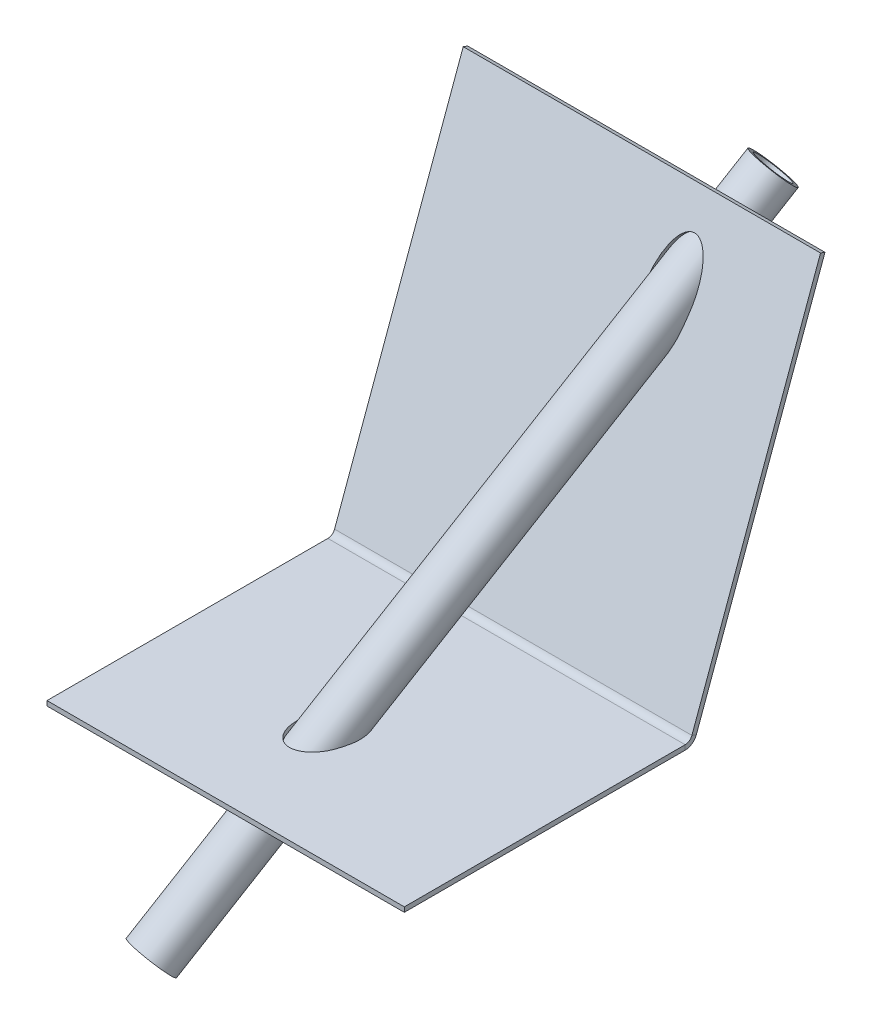
ISO-10303-21;
HEADER;
FILE_DESCRIPTION(('STEP AP214'),'2;1');
FILE_NAME('part.step','',(''),(''),'','','');
FILE_SCHEMA(('AUTOMOTIVE_DESIGN { 1 0 10303 214 1 1 1 1 }'));
ENDSEC;
DATA;
#1=APPLICATION_CONTEXT('core data for automotive mechanical design processes');
#2=APPLICATION_PROTOCOL_DEFINITION('international standard','automotive_design',2000,#1);
#3=PRODUCT_CONTEXT('',#1,'mechanical');
#4=PRODUCT('Part','Part','',(#3));
#5=PRODUCT_RELATED_PRODUCT_CATEGORY('part','',(#4));
#6=PRODUCT_DEFINITION_FORMATION('','',#4);
#7=PRODUCT_DEFINITION_CONTEXT('part definition',#1,'design');
#8=PRODUCT_DEFINITION('design','',#6,#7);
#9=PRODUCT_DEFINITION_SHAPE('','',#8);
#10=(LENGTH_UNIT() NAMED_UNIT(*) SI_UNIT(.MILLI.,.METRE.));
#11=(NAMED_UNIT(*) PLANE_ANGLE_UNIT() SI_UNIT($,.RADIAN.));
#12=(NAMED_UNIT(*) SI_UNIT($,.STERADIAN.) SOLID_ANGLE_UNIT());
#13=UNCERTAINTY_MEASURE_WITH_UNIT(LENGTH_MEASURE(1.E-05),#10,'distance_accuracy_value','');
#14=(GEOMETRIC_REPRESENTATION_CONTEXT(3) GLOBAL_UNCERTAINTY_ASSIGNED_CONTEXT((#13)) GLOBAL_UNIT_ASSIGNED_CONTEXT((#10,
#11,#12)) REPRESENTATION_CONTEXT('',''));
#15=CARTESIAN_POINT('',(0.,0.,0.));
#16=DIRECTION('',(0.,0.,1.));
#17=DIRECTION('',(1.,0.,0.));
#18=AXIS2_PLACEMENT_3D('',#15,#16,#17);
#19=CARTESIAN_POINT('',(-94.9837693608942,-60.5041507108473,131.214828829502));
#20=DIRECTION('',(0.173648177666931,0.696364240320019,-0.696364240320019));
#21=DIRECTION('',(0.,0.707106781186548,0.707106781186547));
#22=AXIS2_PLACEMENT_3D('',#19,#20,#21);
#23=CYLINDRICAL_SURFACE('',#22,9.50000000000002);
#24=CARTESIAN_POINT('',(-94.9837693608942,-60.5041507108473,131.214828829502));
#25=DIRECTION('',(0.173648177666931,0.696364240320019,-0.696364240320019));
#26=DIRECTION('',(0.,0.707106781186548,0.707106781186547));
#27=AXIS2_PLACEMENT_3D('',#24,#25,#26);
#28=CIRCLE('',#27,9.50000000000002);
#29=CARTESIAN_POINT('',(-94.9837693608942,-53.7866362895751,137.932343250774));
#30=VERTEX_POINT('',#29);
#31=EDGE_CURVE('E12',#30,#30,#28,.T.);
#32=ORIENTED_EDGE('',*,*,#31,.T.);
#33=EDGE_LOOP('',(#32));
#34=FACE_BOUND('',#33,.T.);
#35=CARTESIAN_POINT('',(-42.889316060815,148.405121385158,-77.6944432665036));
#36=DIRECTION('',(0.173648177666931,0.696364240320019,-0.696364240320019));
#37=DIRECTION('',(0.,0.707106781186548,0.707106781186547));
#38=AXIS2_PLACEMENT_3D('',#35,#36,#37);
#39=CIRCLE('',#38,9.50000000000002);
#40=CARTESIAN_POINT('',(-42.889316060815,155.122635806431,-70.9769288452314));
#41=VERTEX_POINT('',#40);
#42=EDGE_CURVE('E107',#41,#41,#39,.T.);
#43=ORIENTED_EDGE('',*,*,#42,.F.);
#44=EDGE_LOOP('',(#43));
#45=FACE_BOUND('',#44,.T.);
#46=ADVANCED_FACE('F97',(#34,#45),#23,.T.);
#47=CARTESIAN_POINT('',(-94.9837693608942,-60.5041507108473,131.214828829502));
#48=DIRECTION('',(0.173648177666931,0.696364240320019,-0.696364240320019));
#49=DIRECTION('',(0.,0.707106781186548,0.707106781186547));
#50=AXIS2_PLACEMENT_3D('',#47,#48,#49);
#51=PLANE('',#50);
#52=CARTESIAN_POINT('',(-94.9837693608942,-60.5041507108473,131.214828829502));
#53=DIRECTION('',(0.173648177666931,0.696364240320019,-0.696364240320019));
#54=DIRECTION('',(0.,0.707106781186548,0.707106781186548));
#55=AXIS2_PLACEMENT_3D('',#52,#53,#54);
#56=CIRCLE('',#55,7.50000000000001);
#57=CARTESIAN_POINT('',(-94.9837693608942,-55.2008498519482,136.518129688401));
#58=VERTEX_POINT('',#57);
#59=EDGE_CURVE('E103',#58,#58,#56,.T.);
#60=ORIENTED_EDGE('',*,*,#59,.T.);
#61=EDGE_LOOP('',(#60));
#62=FACE_BOUND('',#61,.T.);
#63=ORIENTED_EDGE('',*,*,#31,.F.);
#64=EDGE_LOOP('',(#63));
#65=FACE_BOUND('',#64,.T.);
#66=ADVANCED_FACE('F126',(#62,#65),#51,.F.);
#67=CARTESIAN_POINT('',(-94.9837693608942,-60.5041507108473,131.214828829502));
#68=DIRECTION('',(0.173648177666931,0.696364240320019,-0.696364240320019));
#69=DIRECTION('',(0.,0.707106781186548,0.707106781186547));
#70=AXIS2_PLACEMENT_3D('',#67,#68,#69);
#71=CYLINDRICAL_SURFACE('',#70,7.50000000000001);
#72=ORIENTED_EDGE('',*,*,#59,.F.);
#73=EDGE_LOOP('',(#72));
#74=FACE_BOUND('',#73,.T.);
#75=CARTESIAN_POINT('',(-42.889316060815,148.405121385158,-77.6944432665036));
#76=DIRECTION('',(0.173648177666931,0.696364240320019,-0.696364240320019));
#77=DIRECTION('',(0.,0.707106781186548,0.707106781186548));
#78=AXIS2_PLACEMENT_3D('',#75,#76,#77);
#79=CIRCLE('',#78,7.50000000000001);
#80=CARTESIAN_POINT('',(-42.889316060815,153.708422244057,-72.3911424076045));
#81=VERTEX_POINT('',#80);
#82=EDGE_CURVE('E111',#81,#81,#79,.T.);
#83=ORIENTED_EDGE('',*,*,#82,.T.);
#84=EDGE_LOOP('',(#83));
#85=FACE_BOUND('',#84,.T.);
#86=ADVANCED_FACE('F117',(#74,#85),#71,.F.);
#87=CARTESIAN_POINT('',(-42.889316060815,148.405121385158,-77.6944432665036));
#88=DIRECTION('',(0.173648177666931,0.696364240320019,-0.696364240320019));
#89=DIRECTION('',(0.,0.707106781186548,0.707106781186547));
#90=AXIS2_PLACEMENT_3D('',#87,#88,#89);
#91=PLANE('',#90);
#92=ORIENTED_EDGE('',*,*,#42,.T.);
#93=EDGE_LOOP('',(#92));
#94=FACE_BOUND('',#93,.T.);
#95=ORIENTED_EDGE('',*,*,#82,.F.);
#96=EDGE_LOOP('',(#95));
#97=FACE_BOUND('',#96,.T.);
#98=ADVANCED_FACE('F119',(#94,#97),#91,.T.);
#99=CLOSED_SHELL('',(#46,#66,#86,#98));
#100=MANIFOLD_SOLID_BREP('B2',#99);
#101=CARTESIAN_POINT('',(-150.,0.,2.10062261462914));
#102=DIRECTION('',(-1.,0.,0.));
#103=DIRECTION('',(0.,0.,1.));
#104=AXIS2_PLACEMENT_3D('',#101,#102,#103);
#105=PLANE('',#104);
#106=DIRECTION('',(0.,-1.,0.));
#107=VECTOR('',#106,1.);
#108=CARTESIAN_POINT('',(-150.,0.,2.10062261462914));
#109=LINE('',#108,#107);
#110=CARTESIAN_POINT('',(-150.,0.,2.10062261462914));
#111=VERTEX_POINT('',#110);
#112=CARTESIAN_POINT('',(-150.,-2.,2.10062261462914));
#113=VERTEX_POINT('',#112);
#114=EDGE_CURVE('E373',#111,#113,#109,.T.);
#115=ORIENTED_EDGE('',*,*,#114,.F.);
#116=CARTESIAN_POINT('',(-150.,3.,2.10062261462914));
#117=DIRECTION('',(-1.,0.,0.));
#118=DIRECTION('',(0.,0.,1.));
#119=AXIS2_PLACEMENT_3D('',#116,#117,#118);
#120=CIRCLE('',#119,3.);
#121=CARTESIAN_POINT('',(-150.,1.97393957002301,-0.718455247728592));
#122=VERTEX_POINT('',#121);
#123=EDGE_CURVE('E435',#111,#122,#120,.F.);
#124=ORIENTED_EDGE('',*,*,#123,.T.);
#125=DIRECTION('',(0.,0.342020143325665,0.93969262078591));
#126=VECTOR('',#125,1.);
#127=CARTESIAN_POINT('',(-150.,1.28989928337168,-2.59784048930041));
#128=LINE('',#127,#126);
#129=CARTESIAN_POINT('',(-150.,1.28989928337168,-2.59784048930041));
#130=VERTEX_POINT('',#129);
#131=EDGE_CURVE('E377',#130,#122,#128,.T.);
#132=ORIENTED_EDGE('',*,*,#131,.F.);
#133=CARTESIAN_POINT('',(-150.,3.,2.10062261462914));
#134=DIRECTION('',(1.,0.,0.));
#135=DIRECTION('',(0.,0.,-1.));
#136=AXIS2_PLACEMENT_3D('',#133,#134,#135);
#137=CIRCLE('',#136,5.);
#138=EDGE_CURVE('E387',#113,#130,#137,.T.);
#139=ORIENTED_EDGE('',*,*,#138,.F.);
#140=EDGE_LOOP('',(#115,#124,#132,#139));
#141=FACE_BOUND('',#140,.T.);
#142=ADVANCED_FACE('F159',(#141),#105,.T.);
#143=CARTESIAN_POINT('',(-150.,1.28989928337168,-2.59784048930041));
#144=DIRECTION('',(-1.,0.,0.));
#145=DIRECTION('',(0.,0.,1.));
#146=AXIS2_PLACEMENT_3D('',#143,#144,#145);
#147=PLANE('',#146);
#148=DIRECTION('',(0.,0.,-1.));
#149=VECTOR('',#148,1.);
#150=CARTESIAN_POINT('',(-150.,0.,120.));
#151=LINE('',#150,#149);
#152=CARTESIAN_POINT('',(-150.,0.,120.));
#153=VERTEX_POINT('',#152);
#154=EDGE_CURVE('E376',#153,#111,#151,.T.);
#155=ORIENTED_EDGE('',*,*,#154,.T.);
#156=ORIENTED_EDGE('',*,*,#114,.T.);
#157=DIRECTION('',(0.,0.,-1.));
#158=VECTOR('',#157,1.);
#159=CARTESIAN_POINT('',(-150.,-2.,120.));
#160=LINE('',#159,#158);
#161=CARTESIAN_POINT('',(-150.,-2.,120.));
#162=VERTEX_POINT('',#161);
#163=EDGE_CURVE('E409',#162,#113,#160,.T.);
#164=ORIENTED_EDGE('',*,*,#163,.F.);
#165=DIRECTION('',(0.,1.,0.));
#166=VECTOR('',#165,1.);
#167=CARTESIAN_POINT('',(-150.,-2.,120.));
#168=LINE('',#167,#166);
#169=EDGE_CURVE('E375',#162,#153,#168,.T.);
#170=ORIENTED_EDGE('',*,*,#169,.T.);
#171=EDGE_LOOP('',(#155,#156,#164,#170));
#172=FACE_BOUND('',#171,.T.);
#173=ADVANCED_FACE('F485',(#172),#147,.T.);
#174=CARTESIAN_POINT('',(0.,1.97393957002301,-0.718455247728592));
#175=DIRECTION('',(1.,0.,0.));
#176=DIRECTION('',(0.,0.,-1.));
#177=AXIS2_PLACEMENT_3D('',#174,#175,#176);
#178=PLANE('',#177);
#179=DIRECTION('',(0.,-0.342020143325665,-0.93969262078591));
#180=VECTOR('',#179,1.);
#181=CARTESIAN_POINT('',(0.,1.97393957002301,-0.718455247728592));
#182=LINE('',#181,#180);
#183=CARTESIAN_POINT('',(0.,1.97393957002301,-0.718455247728592));
#184=VERTEX_POINT('',#183);
#185=CARTESIAN_POINT('',(0.,1.28989928337168,-2.59784048930041));
#186=VERTEX_POINT('',#185);
#187=EDGE_CURVE('E381',#184,#186,#182,.T.);
#188=ORIENTED_EDGE('',*,*,#187,.F.);
#189=CARTESIAN_POINT('',(0.,3.,2.10062261462914));
#190=DIRECTION('',(-1.,0.,0.));
#191=DIRECTION('',(0.,0.,1.));
#192=AXIS2_PLACEMENT_3D('',#189,#190,#191);
#193=CIRCLE('',#192,3.);
#194=CARTESIAN_POINT('',(0.,0.,2.10062261462914));
#195=VERTEX_POINT('',#194);
#196=EDGE_CURVE('E398',#195,#184,#193,.F.);
#197=ORIENTED_EDGE('',*,*,#196,.F.);
#198=DIRECTION('',(0.,1.,0.));
#199=VECTOR('',#198,1.);
#200=CARTESIAN_POINT('',(0.,-2.,2.10062261462914));
#201=LINE('',#200,#199);
#202=CARTESIAN_POINT('',(0.,-2.,2.10062261462914));
#203=VERTEX_POINT('',#202);
#204=EDGE_CURVE('E95',#203,#195,#201,.T.);
#205=ORIENTED_EDGE('',*,*,#204,.F.);
#206=CARTESIAN_POINT('',(0.,3.,2.10062261462914));
#207=DIRECTION('',(1.,0.,0.));
#208=DIRECTION('',(0.,0.,-1.));
#209=AXIS2_PLACEMENT_3D('',#206,#207,#208);
#210=CIRCLE('',#209,5.);
#211=EDGE_CURVE('E383',#203,#186,#210,.T.);
#212=ORIENTED_EDGE('',*,*,#211,.T.);
#213=EDGE_LOOP('',(#188,#197,#205,#212));
#214=FACE_BOUND('',#213,.T.);
#215=ADVANCED_FACE('F469',(#214),#178,.T.);
#216=CARTESIAN_POINT('',(0.,-2.,2.10062261462914));
#217=DIRECTION('',(1.,0.,0.));
#218=DIRECTION('',(0.,0.,-1.));
#219=AXIS2_PLACEMENT_3D('',#216,#217,#218);
#220=PLANE('',#219);
#221=DIRECTION('',(0.,0.93969262078591,-0.342020143325666));
#222=VECTOR('',#221,1.);
#223=CARTESIAN_POINT('',(0.,0.,0.));
#224=LINE('',#223,#222);
#225=CARTESIAN_POINT('',(0.,150.350819325746,-54.7232229321065));
#226=VERTEX_POINT('',#225);
#227=EDGE_CURVE('E394',#184,#226,#224,.T.);
#228=ORIENTED_EDGE('',*,*,#227,.F.);
#229=ORIENTED_EDGE('',*,*,#187,.T.);
#230=DIRECTION('',(0.,0.93969262078591,-0.342020143325666));
#231=VECTOR('',#230,1.);
#232=CARTESIAN_POINT('',(0.,-0.684040286651331,-1.87938524157182));
#233=LINE('',#232,#231);
#234=CARTESIAN_POINT('',(0.,149.666779039094,-56.6026081736783));
#235=VERTEX_POINT('',#234);
#236=EDGE_CURVE('E382',#186,#235,#233,.T.);
#237=ORIENTED_EDGE('',*,*,#236,.T.);
#238=DIRECTION('',(0.,-0.342020143325655,-0.939692620785913));
#239=VECTOR('',#238,1.);
#240=CARTESIAN_POINT('',(0.,150.350819325746,-54.7232229321065));
#241=LINE('',#240,#239);
#242=EDGE_CURVE('E390',#226,#235,#241,.T.);
#243=ORIENTED_EDGE('',*,*,#242,.F.);
#244=EDGE_LOOP('',(#228,#229,#237,#243));
#245=FACE_BOUND('',#244,.T.);
#246=ADVANCED_FACE('F467',(#245),#220,.T.);
#247=CARTESIAN_POINT('',(-150.,-0.684040286651331,-1.87938524157182));
#248=DIRECTION('',(0.,-0.342020143325666,-0.93969262078591));
#249=DIRECTION('',(0.,0.93969262078591,-0.342020143325666));
#250=AXIS2_PLACEMENT_3D('',#247,#248,#249);
#251=PLANE('',#250);
#252=CARTESIAN_POINT('',(-52.1731413119094,110.491068062365,-42.3438154719332));
#253=DIRECTION('',(0.,-0.342020143325666,-0.93969262078591));
#254=DIRECTION('',(0.19097450619064,0.922397575209378,-0.335725261535531));
#255=AXIS2_PLACEMENT_3D('',#252,#253,#254);
#256=ELLIPSE('',#255,22.8256885378825,9.50000000000002);
#257=CARTESIAN_POINT('',(-42.8428854587484,108.810888513388,-41.7322801278828));
#258=VERTEX_POINT('',#257);
#259=CARTESIAN_POINT('',(-61.4748454872845,112.308830651762,-43.0054269474365));
#260=VERTEX_POINT('',#259);
#261=EDGE_CURVE('E361',#258,#260,#256,.T.);
#262=ORIENTED_EDGE('',*,*,#261,.F.);
#263=DIRECTION('',(-0.19097304177923,-0.922397842935195,0.335725358979759));
#264=VECTOR('',#263,1.);
#265=CARTESIAN_POINT('',(-42.0084382959595,112.841243756615,-43.1992094699363));
#266=LINE('',#265,#264);
#267=CARTESIAN_POINT('',(-42.0084382959595,112.841243756615,-43.1992094699363));
#268=VERTEX_POINT('',#267);
#269=EDGE_CURVE('E364',#268,#258,#266,.T.);
#270=ORIENTED_EDGE('',*,*,#269,.F.);
#271=CARTESIAN_POINT('',(-51.3386909500997,114.521422719219,-43.8107446005643));
#272=DIRECTION('',(0.,-0.342020143325666,-0.93969262078591));
#273=DIRECTION('',(0.19097450619064,0.922397575209378,-0.335725261535531));
#274=AXIS2_PLACEMENT_3D('',#271,#272,#273);
#275=ELLIPSE('',#274,22.8256885378825,9.50000000000002);
#276=CARTESIAN_POINT('',(-60.6403951549392,116.33918516798,-44.4723560248802));
#277=VERTEX_POINT('',#276);
#278=EDGE_CURVE('E366',#277,#268,#275,.T.);
#279=ORIENTED_EDGE('',*,*,#278,.F.);
#280=DIRECTION('',(0.190974506190639,0.922397575209378,-0.335725261535531));
#281=VECTOR('',#280,1.);
#282=CARTESIAN_POINT('',(-61.4749125583194,112.308842913835,-43.005431410466));
#283=LINE('',#282,#281);
#284=EDGE_CURVE('E369',#260,#277,#283,.T.);
#285=ORIENTED_EDGE('',*,*,#284,.F.);
#286=EDGE_LOOP('',(#262,#270,#279,#285));
#287=FACE_BOUND('',#286,.T.);
#288=ORIENTED_EDGE('',*,*,#236,.F.);
#289=DIRECTION('',(1.,0.,0.));
#290=VECTOR('',#289,1.);
#291=CARTESIAN_POINT('',(-150.,1.28989928337168,-2.59784048930041));
#292=LINE('',#291,#290);
#293=EDGE_CURVE('E410',#130,#186,#292,.T.);
#294=ORIENTED_EDGE('',*,*,#293,.F.);
#295=DIRECTION('',(0.,0.93969262078591,-0.342020143325666));
#296=VECTOR('',#295,1.);
#297=CARTESIAN_POINT('',(-150.,-0.684040286651331,-1.87938524157182));
#298=LINE('',#297,#296);
#299=CARTESIAN_POINT('',(-150.,149.666779039094,-56.6026081736783));
#300=VERTEX_POINT('',#299);
#301=EDGE_CURVE('E163',#130,#300,#298,.T.);
#302=ORIENTED_EDGE('',*,*,#301,.T.);
#303=DIRECTION('',(1.,0.,0.));
#304=VECTOR('',#303,1.);
#305=CARTESIAN_POINT('',(-150.,149.666779039094,-56.6026081736783));
#306=LINE('',#305,#304);
#307=EDGE_CURVE('E385',#300,#235,#306,.T.);
#308=ORIENTED_EDGE('',*,*,#307,.T.);
#309=EDGE_LOOP('',(#288,#294,#302,#308));
#310=FACE_BOUND('',#309,.T.);
#311=ADVANCED_FACE('F161',(#287,#310),#251,.T.);
#312=CARTESIAN_POINT('',(-150.,3.,2.10062261462914));
#313=DIRECTION('',(1.,0.,0.));
#314=DIRECTION('',(0.,0.,-1.));
#315=AXIS2_PLACEMENT_3D('',#312,#313,#314);
#316=CYLINDRICAL_SURFACE('',#315,5.);
#317=ORIENTED_EDGE('',*,*,#211,.F.);
#318=DIRECTION('',(1.,0.,0.));
#319=VECTOR('',#318,1.);
#320=CARTESIAN_POINT('',(-150.,-2.,2.10062261462914));
#321=LINE('',#320,#319);
#322=EDGE_CURVE('E406',#113,#203,#321,.T.);
#323=ORIENTED_EDGE('',*,*,#322,.F.);
#324=ORIENTED_EDGE('',*,*,#138,.T.);
#325=ORIENTED_EDGE('',*,*,#293,.T.);
#326=EDGE_LOOP('',(#317,#323,#324,#325));
#327=FACE_BOUND('',#326,.T.);
#328=ADVANCED_FACE('F454',(#327),#316,.T.);
#329=CARTESIAN_POINT('',(-150.,-2.,120.));
#330=DIRECTION('',(0.,-1.,0.));
#331=DIRECTION('',(0.,0.,-1.));
#332=AXIS2_PLACEMENT_3D('',#329,#330,#331);
#333=PLANE('',#332);
#334=CARTESIAN_POINT('',(-79.8962118674255,-2.,70.7106781186548));
#335=DIRECTION('',(0.,-1.,0.));
#336=DIRECTION('',(0.241954785752365,0.,-0.970287525247814));
#337=AXIS2_PLACEMENT_3D('',#334,#335,#336);
#338=ELLIPSE('',#337,13.6422858181722,9.50000000000002);
#339=CARTESIAN_POINT('',(-89.1318092637756,-2.,68.484189855182));
#340=VERTEX_POINT('',#339);
#341=CARTESIAN_POINT('',(-70.6892313999584,-2.,73.0522586911292));
#342=VERTEX_POINT('',#341);
#343=EDGE_CURVE('E299',#340,#342,#338,.T.);
#344=ORIENTED_EDGE('',*,*,#343,.F.);
#345=DIRECTION('',(0.241888526099025,0.,-0.970304045617476));
#346=VECTOR('',#345,1.);
#347=CARTESIAN_POINT('',(-89.6305032301413,-2.,70.4841987581382));
#348=LINE('',#347,#346);
#349=CARTESIAN_POINT('',(-89.6305032301417,-2.,70.48419875814));
#350=VERTEX_POINT('',#349);
#351=EDGE_CURVE('E301',#350,#340,#348,.T.);
#352=ORIENTED_EDGE('',*,*,#351,.F.);
#353=CARTESIAN_POINT('',(-80.3949398824859,-2.,72.7106781186548));
#354=DIRECTION('',(0.,-1.,0.));
#355=DIRECTION('',(0.241954785752365,0.,-0.970287525247814));
#356=AXIS2_PLACEMENT_3D('',#353,#354,#355);
#357=ELLIPSE('',#356,13.6422858181722,9.50000000000002);
#358=CARTESIAN_POINT('',(-71.1879594011612,-2.,75.052258636088));
#359=VERTEX_POINT('',#358);
#360=EDGE_CURVE('E310',#359,#350,#357,.T.);
#361=ORIENTED_EDGE('',*,*,#360,.F.);
#362=DIRECTION('',(-0.241954785752365,0.,0.970287525247814));
#363=VECTOR('',#362,1.);
#364=CARTESIAN_POINT('',(-70.6892070637098,-2.,73.0522647597136));
#365=LINE('',#364,#363);
#366=EDGE_CURVE('E290',#342,#359,#365,.T.);
#367=ORIENTED_EDGE('',*,*,#366,.F.);
#368=EDGE_LOOP('',(#344,#352,#361,#367));
#369=FACE_BOUND('',#368,.T.);
#370=DIRECTION('',(0.,0.,-1.));
#371=VECTOR('',#370,1.);
#372=CARTESIAN_POINT('',(0.,-2.,120.));
#373=LINE('',#372,#371);
#374=CARTESIAN_POINT('',(0.,-2.,120.));
#375=VERTEX_POINT('',#374);
#376=EDGE_CURVE('E168',#375,#203,#373,.T.);
#377=ORIENTED_EDGE('',*,*,#376,.F.);
#378=DIRECTION('',(1.,0.,0.));
#379=VECTOR('',#378,1.);
#380=CARTESIAN_POINT('',(-150.,-2.,120.));
#381=LINE('',#380,#379);
#382=EDGE_CURVE('E403',#162,#375,#381,.T.);
#383=ORIENTED_EDGE('',*,*,#382,.F.);
#384=ORIENTED_EDGE('',*,*,#163,.T.);
#385=ORIENTED_EDGE('',*,*,#322,.T.);
#386=EDGE_LOOP('',(#377,#383,#384,#385));
#387=FACE_BOUND('',#386,.T.);
#388=ADVANCED_FACE('F474',(#369,#387),#333,.T.);
#389=CARTESIAN_POINT('',(-150.,-2.,120.));
#390=DIRECTION('',(0.,0.,-1.));
#391=DIRECTION('',(-1.,0.,0.));
#392=AXIS2_PLACEMENT_3D('',#389,#390,#391);
#393=PLANE('',#392);
#394=DIRECTION('',(0.,1.,0.));
#395=VECTOR('',#394,1.);
#396=CARTESIAN_POINT('',(0.,-2.,120.));
#397=LINE('',#396,#395);
#398=CARTESIAN_POINT('',(0.,0.,120.));
#399=VERTEX_POINT('',#398);
#400=EDGE_CURVE('E405',#375,#399,#397,.T.);
#401=ORIENTED_EDGE('',*,*,#400,.T.);
#402=DIRECTION('',(1.,0.,0.));
#403=VECTOR('',#402,1.);
#404=CARTESIAN_POINT('',(-150.,0.,120.));
#405=LINE('',#404,#403);
#406=EDGE_CURVE('E399',#153,#399,#405,.T.);
#407=ORIENTED_EDGE('',*,*,#406,.F.);
#408=ORIENTED_EDGE('',*,*,#169,.F.);
#409=ORIENTED_EDGE('',*,*,#382,.T.);
#410=EDGE_LOOP('',(#401,#407,#408,#409));
#411=FACE_BOUND('',#410,.T.);
#412=ADVANCED_FACE('F480',(#411),#393,.F.);
#413=CARTESIAN_POINT('',(-150.,0.,120.));
#414=DIRECTION('',(0.,-1.,0.));
#415=DIRECTION('',(0.,0.,-1.));
#416=AXIS2_PLACEMENT_3D('',#413,#414,#415);
#417=PLANE('',#416);
#418=DIRECTION('',(0.241888526099026,0.,-0.970304045617476));
#419=VECTOR('',#418,1.);
#420=CARTESIAN_POINT('',(-89.1319117912763,0.,68.4841647009507));
#421=LINE('',#420,#419);
#422=CARTESIAN_POINT('',(-89.6305032301413,0.,70.4841987581382));
#423=VERTEX_POINT('',#422);
#424=CARTESIAN_POINT('',(-89.1318434396091,0.,68.4841814704382));
#425=VERTEX_POINT('',#424);
#426=EDGE_CURVE('E281',#423,#425,#421,.T.);
#427=ORIENTED_EDGE('',*,*,#426,.T.);
#428=CARTESIAN_POINT('',(-79.8962118674255,0.,70.7106781186548));
#429=DIRECTION('',(0.,-1.,0.));
#430=DIRECTION('',(0.241954785752365,0.,-0.970287525247814));
#431=AXIS2_PLACEMENT_3D('',#428,#429,#430);
#432=ELLIPSE('',#431,13.6422858181722,9.50000000000002);
#433=CARTESIAN_POINT('',(-70.6892313999584,0.,73.0522586911292));
#434=VERTEX_POINT('',#433);
#435=EDGE_CURVE('E293',#425,#434,#432,.T.);
#436=ORIENTED_EDGE('',*,*,#435,.T.);
#437=DIRECTION('',(-0.241954785752365,0.,0.970287525247814));
#438=VECTOR('',#437,1.);
#439=CARTESIAN_POINT('',(-85.76603787104,0.,133.51339929415));
#440=LINE('',#439,#438);
#441=CARTESIAN_POINT('',(-71.1879594011611,0.,75.0522586360879));
#442=VERTEX_POINT('',#441);
#443=EDGE_CURVE('E282',#434,#442,#440,.T.);
#444=ORIENTED_EDGE('',*,*,#443,.T.);
#445=CARTESIAN_POINT('',(-80.3949398824859,0.,72.7106781186548));
#446=DIRECTION('',(0.,-1.,0.));
#447=DIRECTION('',(0.241954785752365,0.,-0.970287525247814));
#448=AXIS2_PLACEMENT_3D('',#445,#446,#447);
#449=ELLIPSE('',#448,13.6422858181722,9.50000000000002);
#450=EDGE_CURVE('E273',#442,#423,#449,.T.);
#451=ORIENTED_EDGE('',*,*,#450,.T.);
#452=EDGE_LOOP('',(#427,#436,#444,#451));
#453=FACE_BOUND('',#452,.T.);
#454=DIRECTION('',(0.,0.,-1.));
#455=VECTOR('',#454,1.);
#456=CARTESIAN_POINT('',(0.,0.,120.));
#457=LINE('',#456,#455);
#458=EDGE_CURVE('E402',#399,#195,#457,.T.);
#459=ORIENTED_EDGE('',*,*,#458,.T.);
#460=DIRECTION('',(1.,0.,0.));
#461=VECTOR('',#460,1.);
#462=CARTESIAN_POINT('',(-150.,0.,2.10062261462914));
#463=LINE('',#462,#461);
#464=EDGE_CURVE('E395',#111,#195,#463,.T.);
#465=ORIENTED_EDGE('',*,*,#464,.F.);
#466=ORIENTED_EDGE('',*,*,#154,.F.);
#467=ORIENTED_EDGE('',*,*,#406,.T.);
#468=EDGE_LOOP('',(#459,#465,#466,#467));
#469=FACE_BOUND('',#468,.T.);
#470=ADVANCED_FACE('F297',(#453,#469),#417,.F.);
#471=CARTESIAN_POINT('',(-150.,3.,2.10062261462914));
#472=DIRECTION('',(1.,0.,0.));
#473=DIRECTION('',(0.,0.,-1.));
#474=AXIS2_PLACEMENT_3D('',#471,#472,#473);
#475=CYLINDRICAL_SURFACE('',#474,3.);
#476=ORIENTED_EDGE('',*,*,#196,.T.);
#477=DIRECTION('',(1.,0.,0.));
#478=VECTOR('',#477,1.);
#479=CARTESIAN_POINT('',(-150.,1.97393957002301,-0.718455247728592));
#480=LINE('',#479,#478);
#481=EDGE_CURVE('E391',#122,#184,#480,.T.);
#482=ORIENTED_EDGE('',*,*,#481,.F.);
#483=ORIENTED_EDGE('',*,*,#123,.F.);
#484=ORIENTED_EDGE('',*,*,#464,.T.);
#485=EDGE_LOOP('',(#476,#482,#483,#484));
#486=FACE_BOUND('',#485,.T.);
#487=ADVANCED_FACE('F461',(#486),#475,.F.);
#488=CARTESIAN_POINT('',(-150.,0.,0.));
#489=DIRECTION('',(0.,-0.342020143325666,-0.93969262078591));
#490=DIRECTION('',(0.,0.93969262078591,-0.342020143325666));
#491=AXIS2_PLACEMENT_3D('',#488,#489,#490);
#492=PLANE('',#491);
#493=DIRECTION('',(-0.19097304177923,-0.922397842935195,0.335725358979758));
#494=VECTOR('',#493,1.);
#495=CARTESIAN_POINT('',(-42.8428822591222,109.494928216598,-39.8528946739557));
#496=LINE('',#495,#494);
#497=CARTESIAN_POINT('',(-42.0084382959595,113.525284043267,-41.3198242283645));
#498=VERTEX_POINT('',#497);
#499=CARTESIAN_POINT('',(-42.8428822591222,109.494928216598,-39.8528946739557));
#500=VERTEX_POINT('',#499);
#501=EDGE_CURVE('E320',#498,#500,#496,.T.);
#502=ORIENTED_EDGE('',*,*,#501,.T.);
#503=CARTESIAN_POINT('',(-52.1731413119094,111.175108349016,-40.4644302303614));
#504=DIRECTION('',(0.,-0.342020143325666,-0.93969262078591));
#505=DIRECTION('',(0.19097450619064,0.922397575209378,-0.335725261535531));
#506=AXIS2_PLACEMENT_3D('',#503,#504,#505);
#507=ELLIPSE('',#506,22.8256885378825,9.50000000000002);
#508=CARTESIAN_POINT('',(-61.4748454872845,112.992870938413,-41.1260417058647));
#509=VERTEX_POINT('',#508);
#510=EDGE_CURVE('E324',#500,#509,#507,.T.);
#511=ORIENTED_EDGE('',*,*,#510,.T.);
#512=DIRECTION('',(0.19097450619064,0.922397575209378,-0.335725261535531));
#513=VECTOR('',#512,1.);
#514=CARTESIAN_POINT('',(-104.308921831667,-93.8932979884914,34.1743656648972));
#515=LINE('',#514,#513);
#516=CARTESIAN_POINT('',(-60.6403951549396,117.02322545463,-42.5929707833078));
#517=VERTEX_POINT('',#516);
#518=EDGE_CURVE('E321',#509,#517,#515,.T.);
#519=ORIENTED_EDGE('',*,*,#518,.T.);
#520=CARTESIAN_POINT('',(-51.3386909500997,115.20546300587,-41.9313593589925));
#521=DIRECTION('',(0.,-0.342020143325666,-0.93969262078591));
#522=DIRECTION('',(0.19097450619064,0.922397575209378,-0.335725261535531));
#523=AXIS2_PLACEMENT_3D('',#520,#521,#522);
#524=ELLIPSE('',#523,22.8256885378825,9.50000000000002);
#525=EDGE_CURVE('E317',#517,#498,#524,.T.);
#526=ORIENTED_EDGE('',*,*,#525,.T.);
#527=EDGE_LOOP('',(#502,#511,#519,#526));
#528=FACE_BOUND('',#527,.T.);
#529=ORIENTED_EDGE('',*,*,#227,.T.);
#530=DIRECTION('',(1.,0.,0.));
#531=VECTOR('',#530,1.);
#532=CARTESIAN_POINT('',(-150.,150.350819325746,-54.7232229321065));
#533=LINE('',#532,#531);
#534=CARTESIAN_POINT('',(-150.,150.350819325746,-54.7232229321065));
#535=VERTEX_POINT('',#534);
#536=EDGE_CURVE('E380',#535,#226,#533,.T.);
#537=ORIENTED_EDGE('',*,*,#536,.F.);
#538=DIRECTION('',(0.,0.93969262078591,-0.342020143325666));
#539=VECTOR('',#538,1.);
#540=CARTESIAN_POINT('',(-150.,0.,0.));
#541=LINE('',#540,#539);
#542=EDGE_CURVE('E379',#122,#535,#541,.T.);
#543=ORIENTED_EDGE('',*,*,#542,.F.);
#544=ORIENTED_EDGE('',*,*,#481,.T.);
#545=EDGE_LOOP('',(#529,#537,#543,#544));
#546=FACE_BOUND('',#545,.T.);
#547=ADVANCED_FACE('F465',(#528,#546),#492,.F.);
#548=CARTESIAN_POINT('',(-150.,150.350819325746,-54.7232229321065));
#549=DIRECTION('',(0.,-0.939692620785913,0.342020143325655));
#550=DIRECTION('',(0.,-0.342020143325655,-0.939692620785913));
#551=AXIS2_PLACEMENT_3D('',#548,#549,#550);
#552=PLANE('',#551);
#553=ORIENTED_EDGE('',*,*,#242,.T.);
#554=ORIENTED_EDGE('',*,*,#307,.F.);
#555=DIRECTION('',(0.,-0.342020143325655,-0.939692620785913));
#556=VECTOR('',#555,1.);
#557=CARTESIAN_POINT('',(-150.,150.350819325746,-54.7232229321065));
#558=LINE('',#557,#556);
#559=EDGE_CURVE('E417',#535,#300,#558,.T.);
#560=ORIENTED_EDGE('',*,*,#559,.F.);
#561=ORIENTED_EDGE('',*,*,#536,.T.);
#562=EDGE_LOOP('',(#553,#554,#560,#561));
#563=FACE_BOUND('',#562,.T.);
#564=ADVANCED_FACE('F447',(#563),#552,.F.);
#565=CARTESIAN_POINT('',(-150.,3.,2.10062261462914));
#566=DIRECTION('',(-1.,0.,0.));
#567=DIRECTION('',(0.,0.,1.));
#568=AXIS2_PLACEMENT_3D('',#565,#566,#567);
#569=PLANE('',#568);
#570=ORIENTED_EDGE('',*,*,#301,.F.);
#571=ORIENTED_EDGE('',*,*,#131,.T.);
#572=ORIENTED_EDGE('',*,*,#542,.T.);
#573=ORIENTED_EDGE('',*,*,#559,.T.);
#574=EDGE_LOOP('',(#570,#571,#572,#573));
#575=FACE_BOUND('',#574,.T.);
#576=ADVANCED_FACE('F442',(#575),#569,.T.);
#577=CARTESIAN_POINT('',(0.,3.,2.10062261462914));
#578=DIRECTION('',(-1.,0.,0.));
#579=DIRECTION('',(0.,0.,1.));
#580=AXIS2_PLACEMENT_3D('',#577,#578,#579);
#581=PLANE('',#580);
#582=ORIENTED_EDGE('',*,*,#376,.T.);
#583=ORIENTED_EDGE('',*,*,#204,.T.);
#584=ORIENTED_EDGE('',*,*,#458,.F.);
#585=ORIENTED_EDGE('',*,*,#400,.F.);
#586=EDGE_LOOP('',(#582,#583,#584,#585));
#587=FACE_BOUND('',#586,.T.);
#588=ADVANCED_FACE('F477',(#587),#581,.F.);
#589=CARTESIAN_POINT('',(-42.0084382959595,113.525284043267,-41.3198242283645));
#590=CARTESIAN_POINT('',(-42.2865862836804,112.181832101044,-40.8308477102283));
#591=CARTESIAN_POINT('',(-42.5647342714014,110.83838015882,-40.3418711920919));
#592=CARTESIAN_POINT('',(-42.8428822591222,109.494928216598,-39.8528946739557));
#593=CARTESIAN_POINT('',(-42.0084382959595,112.841243756615,-43.1992094699363));
#594=CARTESIAN_POINT('',(-42.2865862836804,111.497791814392,-42.7102329518));
#595=CARTESIAN_POINT('',(-42.5647342714013,110.154339872169,-42.2212564336637));
#596=CARTESIAN_POINT('',(-42.8428822591222,108.810887929946,-41.7322799155275));
#597=B_SPLINE_SURFACE_WITH_KNOTS('',1,3,((#589,#590,#591,#592),(#593,#594,#595,#596)),
.UNSPECIFIED.,.F.,.F.,.F.,(2,2),(4,4),(0.,1.),(0.,1.),.UNSPECIFIED.);
#598=DIRECTION('',(0.,-0.342020143325666,-0.939692620785909));
#599=VECTOR('',#598,1.);
#600=CARTESIAN_POINT('',(-42.0084382959595,113.525284043267,-41.3198242283645));
#601=LINE('',#600,#599);
#602=EDGE_CURVE('E314',#268,#498,#601,.F.);
#603=CARTESIAN_POINT('',(-42.8428822591222,108.810887929946,-41.7322799155275));
#604=CARTESIAN_POINT('',(-42.8428822591222,109.494928216598,-39.8528946739557));
#605=B_SPLINE_CURVE_WITH_KNOTS('',1,(#603,#604),.UNSPECIFIED.,.F.,.F.,(2,2),(0.,1.),.UNSPECIFIED.);
#606=EDGE_CURVE('E352',#258,#500,#605,.T.);
#607=ORIENTED_EDGE('',*,*,#602,.F.);
#608=ORIENTED_EDGE('',*,*,#269,.T.);
#609=ORIENTED_EDGE('',*,*,#606,.T.);
#610=ORIENTED_EDGE('',*,*,#501,.F.);
#611=EDGE_LOOP('',(#607,#608,#609,#610));
#612=FACE_BOUND('',#611,.T.);
#613=ADVANCED_FACE('F335',(#612),#597,.T.);
#614=DIRECTION('',(0.,-0.342020143325666,-0.939692620785909));
#615=VECTOR('',#614,1.);
#616=SURFACE_OF_LINEAR_EXTRUSION('',#507,#615);
#617=ORIENTED_EDGE('',*,*,#606,.F.);
#618=ORIENTED_EDGE('',*,*,#261,.T.);
#619=CARTESIAN_POINT('',(-61.4747784162497,112.308818389689,-43.005422484407));
#620=DIRECTION('',(0.,0.342020143325668,0.939692620785909));
#621=VECTOR('',#620,1.);
#622=LINE('',#619,#621);
#623=EDGE_CURVE('E526',#260,#509,#622,.T.);
#624=ORIENTED_EDGE('',*,*,#623,.T.);
#625=ORIENTED_EDGE('',*,*,#510,.F.);
#626=EDGE_LOOP('',(#617,#618,#624,#625));
#627=FACE_BOUND('',#626,.T.);
#628=ADVANCED_FACE('F544',(#627),#616,.F.);
#629=CARTESIAN_POINT('',(-61.4749125583194,112.992883200486,-41.1260461688942));
#630=CARTESIAN_POINT('',(-61.1967624377161,114.336334752771,-41.6150225451045));
#631=CARTESIAN_POINT('',(-60.9186123171129,115.679786305056,-42.1039989213149));
#632=CARTESIAN_POINT('',(-60.6404621965096,117.02323785734,-42.5929752975253));
#633=CARTESIAN_POINT('',(-61.4749125583194,112.308842913835,-43.005431410466));
#634=CARTESIAN_POINT('',(-61.1967624377161,113.65229446612,-43.4944077866764));
#635=CARTESIAN_POINT('',(-60.9186123171129,114.995746018404,-43.9833841628867));
#636=CARTESIAN_POINT('',(-60.6404621965096,116.339197570689,-44.4723605390971));
#637=B_SPLINE_SURFACE_WITH_KNOTS('',1,3,((#629,#630,#631,#632),(#633,#634,#635,#636)),
.UNSPECIFIED.,.F.,.F.,.F.,(2,2),(4,4),(0.,1.),(0.,1.),.UNSPECIFIED.);
#638=CARTESIAN_POINT('',(-60.6404621965096,116.339197570689,-44.4723605390971));
#639=CARTESIAN_POINT('',(-60.6404621965096,117.02323785734,-42.5929752975253));
#640=B_SPLINE_CURVE_WITH_KNOTS('',1,(#638,#639),.UNSPECIFIED.,.F.,.F.,(2,2),(0.,1.),.UNSPECIFIED.);
#641=EDGE_CURVE('E176',#277,#517,#640,.T.);
#642=ORIENTED_EDGE('',*,*,#623,.F.);
#643=ORIENTED_EDGE('',*,*,#284,.T.);
#644=ORIENTED_EDGE('',*,*,#641,.T.);
#645=ORIENTED_EDGE('',*,*,#518,.F.);
#646=EDGE_LOOP('',(#642,#643,#644,#645));
#647=FACE_BOUND('',#646,.T.);
#648=ADVANCED_FACE('F334',(#647),#637,.T.);
#649=DIRECTION('',(0.,-0.342020143325666,-0.939692620785909));
#650=VECTOR('',#649,1.);
#651=SURFACE_OF_LINEAR_EXTRUSION('',#524,#650);
#652=ORIENTED_EDGE('',*,*,#278,.T.);
#653=ORIENTED_EDGE('',*,*,#602,.T.);
#654=ORIENTED_EDGE('',*,*,#525,.F.);
#655=ORIENTED_EDGE('',*,*,#641,.F.);
#656=EDGE_LOOP('',(#652,#653,#654,#655));
#657=FACE_BOUND('',#656,.T.);
#658=ADVANCED_FACE('F328',(#657),#651,.F.);
#659=CARTESIAN_POINT('',(-89.6305032301413,0.,70.4841987581382));
#660=CARTESIAN_POINT('',(-89.4643060838529,0.,69.8175207390756));
#661=CARTESIAN_POINT('',(-89.2981089375646,0.,69.1508427200132));
#662=CARTESIAN_POINT('',(-89.1319117912763,0.,68.4841647009507));
#663=CARTESIAN_POINT('',(-89.6305032301413,-2.,70.4841987581382));
#664=CARTESIAN_POINT('',(-89.4643060838529,-2.,69.8175207390756));
#665=CARTESIAN_POINT('',(-89.2981089375646,-2.,69.1508427200132));
#666=CARTESIAN_POINT('',(-89.1319117912763,-2.,68.4841647009507));
#667=B_SPLINE_SURFACE_WITH_KNOTS('',1,3,((#659,#660,#661,#662),(#663,#664,#665,#666)),
.UNSPECIFIED.,.F.,.F.,.F.,(2,2),(4,4),(0.,1.),(0.,1.),.UNSPECIFIED.);
#668=DIRECTION('',(0.,-1.,0.));
#669=VECTOR('',#668,1.);
#670=CARTESIAN_POINT('',(-89.6305032301413,0.,70.4841987581382));
#671=LINE('',#670,#669);
#672=EDGE_CURVE('E276',#350,#423,#671,.F.);
#673=CARTESIAN_POINT('',(-89.1319117912763,-2.,68.4841647009507));
#674=CARTESIAN_POINT('',(-89.1319117912763,0.,68.4841647009507));
#675=B_SPLINE_CURVE_WITH_KNOTS('',1,(#673,#674),.UNSPECIFIED.,.F.,.F.,(2,2),(0.,1.),.UNSPECIFIED.);
#676=EDGE_CURVE('E830',#340,#425,#675,.T.);
#677=ORIENTED_EDGE('',*,*,#672,.F.);
#678=ORIENTED_EDGE('',*,*,#351,.T.);
#679=ORIENTED_EDGE('',*,*,#676,.T.);
#680=ORIENTED_EDGE('',*,*,#426,.F.);
#681=EDGE_LOOP('',(#677,#678,#679,#680));
#682=FACE_BOUND('',#681,.T.);
#683=ADVANCED_FACE('F333',(#682),#667,.T.);
#684=DIRECTION('',(0.,-1.,0.));
#685=VECTOR('',#684,1.);
#686=SURFACE_OF_LINEAR_EXTRUSION('',#432,#685);
#687=ORIENTED_EDGE('',*,*,#676,.F.);
#688=ORIENTED_EDGE('',*,*,#343,.T.);
#689=CARTESIAN_POINT('',(-70.689255736207,-2.,73.0522526225448));
#690=DIRECTION('',(0.,1.,0.));
#691=VECTOR('',#690,1.);
#692=LINE('',#689,#691);
#693=EDGE_CURVE('E292',#342,#434,#692,.T.);
#694=ORIENTED_EDGE('',*,*,#693,.T.);
#695=ORIENTED_EDGE('',*,*,#435,.F.);
#696=EDGE_LOOP('',(#687,#688,#694,#695));
#697=FACE_BOUND('',#696,.T.);
#698=ADVANCED_FACE('F672',(#697),#686,.F.);
#699=CARTESIAN_POINT('',(-70.6892070637098,0.,73.0522647597136));
#700=CARTESIAN_POINT('',(-70.8554497353966,0.,73.7189314263803));
#701=CARTESIAN_POINT('',(-71.0216924070834,0.,74.385598093047));
#702=CARTESIAN_POINT('',(-71.1879350787702,0.,75.0522647597136));
#703=CARTESIAN_POINT('',(-70.6892070637098,-2.,73.0522647597136));
#704=CARTESIAN_POINT('',(-70.8554497353966,-2.,73.7189314263803));
#705=CARTESIAN_POINT('',(-71.0216924070834,-2.,74.385598093047));
#706=CARTESIAN_POINT('',(-71.1879350787702,-2.,75.0522647597136));
#707=B_SPLINE_SURFACE_WITH_KNOTS('',1,3,((#699,#700,#701,#702),(#703,#704,#705,#706)),
.UNSPECIFIED.,.F.,.F.,.F.,(2,2),(4,4),(0.,1.),(0.,1.),.UNSPECIFIED.);
#708=CARTESIAN_POINT('',(-71.1879350787702,-2.,75.0522647597136));
#709=CARTESIAN_POINT('',(-71.1879350787702,0.,75.0522647597136));
#710=B_SPLINE_CURVE_WITH_KNOTS('',1,(#708,#709),.UNSPECIFIED.,.F.,.F.,(2,2),(0.,1.),.UNSPECIFIED.);
#711=EDGE_CURVE('E185',#359,#442,#710,.T.);
#712=ORIENTED_EDGE('',*,*,#693,.F.);
#713=ORIENTED_EDGE('',*,*,#366,.T.);
#714=ORIENTED_EDGE('',*,*,#711,.T.);
#715=ORIENTED_EDGE('',*,*,#443,.F.);
#716=EDGE_LOOP('',(#712,#713,#714,#715));
#717=FACE_BOUND('',#716,.T.);
#718=ADVANCED_FACE('F287',(#717),#707,.T.);
#719=DIRECTION('',(0.,-1.,0.));
#720=VECTOR('',#719,1.);
#721=SURFACE_OF_LINEAR_EXTRUSION('',#449,#720);
#722=ORIENTED_EDGE('',*,*,#360,.T.);
#723=ORIENTED_EDGE('',*,*,#672,.T.);
#724=ORIENTED_EDGE('',*,*,#450,.F.);
#725=ORIENTED_EDGE('',*,*,#711,.F.);
#726=EDGE_LOOP('',(#722,#723,#724,#725));
#727=FACE_BOUND('',#726,.T.);
#728=ADVANCED_FACE('F274',(#727),#721,.F.);
#729=CLOSED_SHELL('',(#142,#173,#215,#246,#311,#328,#388,#412,#470,#487,#547,#564,#576,#588,
#613,#628,#648,#658,#683,#698,#718,#728));
#730=MANIFOLD_SOLID_BREP('B7',#729);
#731=ADVANCED_BREP_SHAPE_REPRESENTATION('',(#18,#100,#730),#14);
#732=SHAPE_DEFINITION_REPRESENTATION(#9,#731);
ENDSEC;
END-ISO-10303-21;
